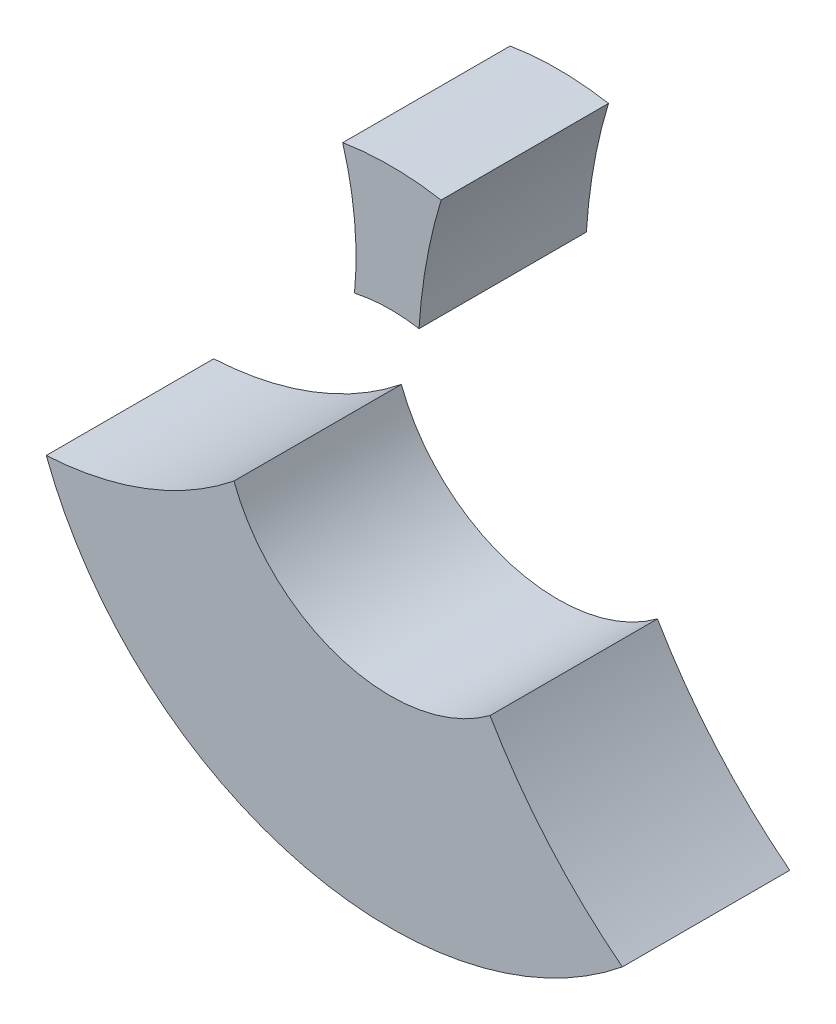
ISO-10303-21;
HEADER;
FILE_DESCRIPTION(('STEP AP214'),'2;1');
FILE_NAME('part.step','',(''),(''),'','','');
FILE_SCHEMA(('AUTOMOTIVE_DESIGN { 1 0 10303 214 1 1 1 1 }'));
ENDSEC;
DATA;
#1=APPLICATION_CONTEXT('core data for automotive mechanical design processes');
#2=APPLICATION_PROTOCOL_DEFINITION('international standard','automotive_design',2000,#1);
#3=PRODUCT_CONTEXT('',#1,'mechanical');
#4=PRODUCT('Part','Part','',(#3));
#5=PRODUCT_RELATED_PRODUCT_CATEGORY('part','',(#4));
#6=PRODUCT_DEFINITION_FORMATION('','',#4);
#7=PRODUCT_DEFINITION_CONTEXT('part definition',#1,'design');
#8=PRODUCT_DEFINITION('design','',#6,#7);
#9=PRODUCT_DEFINITION_SHAPE('','',#8);
#10=(LENGTH_UNIT() NAMED_UNIT(*) SI_UNIT(.MILLI.,.METRE.));
#11=(NAMED_UNIT(*) PLANE_ANGLE_UNIT() SI_UNIT($,.RADIAN.));
#12=(NAMED_UNIT(*) SI_UNIT($,.STERADIAN.) SOLID_ANGLE_UNIT());
#13=UNCERTAINTY_MEASURE_WITH_UNIT(LENGTH_MEASURE(1.E-05),#10,'distance_accuracy_value','');
#14=(GEOMETRIC_REPRESENTATION_CONTEXT(3) GLOBAL_UNCERTAINTY_ASSIGNED_CONTEXT((#13)) GLOBAL_UNIT_ASSIGNED_CONTEXT((#10,
#11,#12)) REPRESENTATION_CONTEXT('',''));
#15=CARTESIAN_POINT('',(0.,0.,0.));
#16=DIRECTION('',(0.,0.,1.));
#17=DIRECTION('',(1.,0.,0.));
#18=AXIS2_PLACEMENT_3D('',#15,#16,#17);
#19=CARTESIAN_POINT('',(0.,0.,6.));
#20=DIRECTION('',(0.,0.,1.));
#21=DIRECTION('',(1.,0.,0.));
#22=AXIS2_PLACEMENT_3D('',#19,#20,#21);
#23=PLANE('',#22);
#24=CARTESIAN_POINT('',(-12.9505437114287,7.00298746775054,6.));
#25=DIRECTION('',(0.,0.,1.));
#26=DIRECTION('',(1.,0.,0.));
#27=AXIS2_PLACEMENT_3D('',#24,#25,#26);
#28=CIRCLE('',#27,11.7196472156143);
#29=CARTESIAN_POINT('',(-12.3347308970566,-4.70046951880307,6.));
#30=VERTEX_POINT('',#29);
#31=CARTESIAN_POINT('',(-5.608507772692,-2.13181625935573,6.));
#32=VERTEX_POINT('',#31);
#33=EDGE_CURVE('E51',#30,#32,#28,.T.);
#34=ORIENTED_EDGE('',*,*,#33,.F.);
#35=CARTESIAN_POINT('',(0.,0.,6.));
#36=DIRECTION('',(0.,0.,1.));
#37=DIRECTION('',(1.,0.,0.));
#38=AXIS2_PLACEMENT_3D('',#35,#36,#37);
#39=CIRCLE('',#38,13.2);
#40=CARTESIAN_POINT('',(8.31171531668762,-10.2545301449818,6.));
#41=VERTEX_POINT('',#40);
#42=EDGE_CURVE('E114',#30,#41,#39,.T.);
#43=ORIENTED_EDGE('',*,*,#42,.T.);
#44=CARTESIAN_POINT('',(20.0229159561683,4.75006481577668,6.));
#45=DIRECTION('',(0.,0.,-1.));
#46=DIRECTION('',(-1.,0.,0.));
#47=AXIS2_PLACEMENT_3D('',#44,#45,#46);
#48=CIRCLE('',#47,19.0339194690582);
#49=CARTESIAN_POINT('',(3.57084024620545,-4.8217320473124,6.));
#50=VERTEX_POINT('',#49);
#51=EDGE_CURVE('E81',#41,#50,#48,.T.);
#52=ORIENTED_EDGE('',*,*,#51,.T.);
#53=CARTESIAN_POINT('',(0.,0.,6.));
#54=DIRECTION('',(0.,0.,1.));
#55=DIRECTION('',(1.,0.,0.));
#56=AXIS2_PLACEMENT_3D('',#53,#54,#55);
#57=CIRCLE('',#56,6.);
#58=EDGE_CURVE('E105',#32,#50,#57,.T.);
#59=ORIENTED_EDGE('',*,*,#58,.F.);
#60=EDGE_LOOP('',(#34,#43,#52,#59));
#61=FACE_BOUND('',#60,.T.);
#62=ADVANCED_FACE('F47',(#61),#23,.T.);
#63=CARTESIAN_POINT('',(0.,0.,0.));
#64=DIRECTION('',(0.,0.,1.));
#65=DIRECTION('',(1.,0.,0.));
#66=AXIS2_PLACEMENT_3D('',#63,#64,#65);
#67=PLANE('',#66);
#68=CARTESIAN_POINT('',(0.,0.,0.));
#69=DIRECTION('',(0.,0.,1.));
#70=DIRECTION('',(1.,0.,0.));
#71=AXIS2_PLACEMENT_3D('',#68,#69,#70);
#72=CIRCLE('',#71,13.2);
#73=CARTESIAN_POINT('',(-12.3347308970566,-4.70046951880307,0.));
#74=VERTEX_POINT('',#73);
#75=CARTESIAN_POINT('',(8.31171531668762,-10.2545301449818,0.));
#76=VERTEX_POINT('',#75);
#77=EDGE_CURVE('E109',#74,#76,#72,.T.);
#78=ORIENTED_EDGE('',*,*,#77,.F.);
#79=CARTESIAN_POINT('',(-12.9505437114287,7.00298746775054,0.));
#80=DIRECTION('',(0.,0.,1.));
#81=DIRECTION('',(1.,0.,0.));
#82=AXIS2_PLACEMENT_3D('',#79,#80,#81);
#83=CIRCLE('',#82,11.7196472156143);
#84=CARTESIAN_POINT('',(-5.608507772692,-2.13181625935573,0.));
#85=VERTEX_POINT('',#84);
#86=EDGE_CURVE('E68',#74,#85,#83,.T.);
#87=ORIENTED_EDGE('',*,*,#86,.T.);
#88=CARTESIAN_POINT('',(0.,0.,0.));
#89=DIRECTION('',(0.,0.,1.));
#90=DIRECTION('',(1.,0.,0.));
#91=AXIS2_PLACEMENT_3D('',#88,#89,#90);
#92=CIRCLE('',#91,6.);
#93=CARTESIAN_POINT('',(3.57084024620545,-4.8217320473124,0.));
#94=VERTEX_POINT('',#93);
#95=EDGE_CURVE('E103',#85,#94,#92,.T.);
#96=ORIENTED_EDGE('',*,*,#95,.T.);
#97=CARTESIAN_POINT('',(20.0229159561683,4.75006481577668,0.));
#98=DIRECTION('',(0.,0.,-1.));
#99=DIRECTION('',(-1.,0.,0.));
#100=AXIS2_PLACEMENT_3D('',#97,#98,#99);
#101=CIRCLE('',#100,19.0339194690582);
#102=EDGE_CURVE('E90',#76,#94,#101,.T.);
#103=ORIENTED_EDGE('',*,*,#102,.F.);
#104=EDGE_LOOP('',(#78,#87,#96,#103));
#105=FACE_BOUND('',#104,.T.);
#106=ADVANCED_FACE('F107',(#105),#67,.F.);
#107=CARTESIAN_POINT('',(0.,0.,6.));
#108=DIRECTION('',(0.,0.,-1.));
#109=DIRECTION('',(-1.,0.,0.));
#110=AXIS2_PLACEMENT_3D('',#107,#108,#109);
#111=CYLINDRICAL_SURFACE('',#110,13.2);
#112=ORIENTED_EDGE('',*,*,#42,.F.);
#113=DIRECTION('',(0.,0.,1.));
#114=VECTOR('',#113,1.);
#115=CARTESIAN_POINT('',(-12.3347308970566,-4.70046951880307,3.));
#116=LINE('',#115,#114);
#117=EDGE_CURVE('E63',#30,#74,#116,.F.);
#118=ORIENTED_EDGE('',*,*,#117,.T.);
#119=ORIENTED_EDGE('',*,*,#77,.T.);
#120=DIRECTION('',(0.,0.,1.));
#121=VECTOR('',#120,1.);
#122=CARTESIAN_POINT('',(8.31171531668763,-10.2545301449818,3.));
#123=LINE('',#122,#121);
#124=EDGE_CURVE('E88',#41,#76,#123,.F.);
#125=ORIENTED_EDGE('',*,*,#124,.F.);
#126=EDGE_LOOP('',(#112,#118,#119,#125));
#127=FACE_BOUND('',#126,.T.);
#128=ADVANCED_FACE('F121',(#127),#111,.T.);
#129=CARTESIAN_POINT('',(0.,0.,6.));
#130=DIRECTION('',(0.,0.,-1.));
#131=DIRECTION('',(-1.,0.,0.));
#132=AXIS2_PLACEMENT_3D('',#129,#130,#131);
#133=CYLINDRICAL_SURFACE('',#132,6.);
#134=DIRECTION('',(0.,0.,1.));
#135=VECTOR('',#134,1.);
#136=CARTESIAN_POINT('',(-5.608507772692,-2.13181625935573,3.));
#137=LINE('',#136,#135);
#138=EDGE_CURVE('E12',#32,#85,#137,.F.);
#139=ORIENTED_EDGE('',*,*,#138,.F.);
#140=ORIENTED_EDGE('',*,*,#58,.T.);
#141=DIRECTION('',(0.,0.,1.));
#142=VECTOR('',#141,1.);
#143=CARTESIAN_POINT('',(3.57084024620545,-4.82173204731239,3.));
#144=LINE('',#143,#142);
#145=EDGE_CURVE('E93',#50,#94,#144,.F.);
#146=ORIENTED_EDGE('',*,*,#145,.T.);
#147=ORIENTED_EDGE('',*,*,#95,.F.);
#148=EDGE_LOOP('',(#139,#140,#146,#147));
#149=FACE_BOUND('',#148,.T.);
#150=ADVANCED_FACE('F102',(#149),#133,.F.);
#151=CARTESIAN_POINT('',(20.0229159561683,4.75006481577668,0.));
#152=DIRECTION('',(0.,0.,1.));
#153=DIRECTION('',(1.,0.,0.));
#154=AXIS2_PLACEMENT_3D('',#151,#152,#153);
#155=CYLINDRICAL_SURFACE('',#154,19.0339194690582);
#156=ORIENTED_EDGE('',*,*,#124,.T.);
#157=ORIENTED_EDGE('',*,*,#102,.T.);
#158=ORIENTED_EDGE('',*,*,#145,.F.);
#159=ORIENTED_EDGE('',*,*,#51,.F.);
#160=EDGE_LOOP('',(#156,#157,#158,#159));
#161=FACE_BOUND('',#160,.T.);
#162=ADVANCED_FACE('F92',(#161),#155,.F.);
#163=CARTESIAN_POINT('',(-12.9505437114287,7.00298746775054,0.));
#164=DIRECTION('',(0.,0.,1.));
#165=DIRECTION('',(1.,0.,0.));
#166=AXIS2_PLACEMENT_3D('',#163,#164,#165);
#167=CYLINDRICAL_SURFACE('',#166,11.7196472156143);
#168=ORIENTED_EDGE('',*,*,#33,.T.);
#169=ORIENTED_EDGE('',*,*,#138,.T.);
#170=ORIENTED_EDGE('',*,*,#86,.F.);
#171=ORIENTED_EDGE('',*,*,#117,.F.);
#172=EDGE_LOOP('',(#168,#169,#170,#171));
#173=FACE_BOUND('',#172,.T.);
#174=ADVANCED_FACE('F49',(#173),#167,.F.);
#175=CLOSED_SHELL('',(#62,#106,#128,#150,#162,#174));
#176=MANIFOLD_SOLID_BREP('B2',#175);
#177=CARTESIAN_POINT('',(0.,0.,6.));
#178=DIRECTION('',(0.,0.,-1.));
#179=DIRECTION('',(-1.,0.,0.));
#180=AXIS2_PLACEMENT_3D('',#177,#178,#179);
#181=CYLINDRICAL_SURFACE('',#180,6.);
#182=DIRECTION('',(0.,0.,1.));
#183=VECTOR('',#182,1.);
#184=CARTESIAN_POINT('',(-1.28672641628347,5.86040400737341,3.));
#185=LINE('',#184,#183);
#186=CARTESIAN_POINT('',(-1.28672641628347,5.86040400737341,0.));
#187=VERTEX_POINT('',#186);
#188=CARTESIAN_POINT('',(-1.28672641628347,5.86040400737341,6.));
#189=VERTEX_POINT('',#188);
#190=EDGE_CURVE('E45',#187,#189,#185,.T.);
#191=ORIENTED_EDGE('',*,*,#190,.F.);
#192=CARTESIAN_POINT('',(0.,0.,0.));
#193=DIRECTION('',(0.,0.,1.));
#194=DIRECTION('',(1.,0.,0.));
#195=AXIS2_PLACEMENT_3D('',#192,#193,#194);
#196=CIRCLE('',#195,6.);
#197=CARTESIAN_POINT('',(1.02448822055343,5.91188835195213,0.));
#198=VERTEX_POINT('',#197);
#199=EDGE_CURVE('E241',#198,#187,#196,.T.);
#200=ORIENTED_EDGE('',*,*,#199,.F.);
#201=DIRECTION('',(0.,0.,1.));
#202=VECTOR('',#201,1.);
#203=CARTESIAN_POINT('',(1.02448822055343,5.91188835195213,3.));
#204=LINE('',#203,#202);
#205=CARTESIAN_POINT('',(1.02448822055343,5.91188835195213,6.));
#206=VERTEX_POINT('',#205);
#207=EDGE_CURVE('E191',#198,#206,#204,.T.);
#208=ORIENTED_EDGE('',*,*,#207,.T.);
#209=CARTESIAN_POINT('',(0.,0.,6.));
#210=DIRECTION('',(0.,0.,1.));
#211=DIRECTION('',(1.,0.,0.));
#212=AXIS2_PLACEMENT_3D('',#209,#210,#211);
#213=CIRCLE('',#212,6.);
#214=EDGE_CURVE('E250',#206,#189,#213,.T.);
#215=ORIENTED_EDGE('',*,*,#214,.T.);
#216=EDGE_LOOP('',(#191,#200,#208,#215));
#217=FACE_BOUND('',#216,.T.);
#218=ADVANCED_FACE('F183',(#217),#181,.F.);
#219=CARTESIAN_POINT('',(0.,0.,0.));
#220=DIRECTION('',(0.,0.,1.));
#221=DIRECTION('',(1.,0.,0.));
#222=AXIS2_PLACEMENT_3D('',#219,#220,#221);
#223=PLANE('',#222);
#224=ORIENTED_EDGE('',*,*,#199,.T.);
#225=CARTESIAN_POINT('',(-12.9505437114287,7.00298746775054,0.));
#226=DIRECTION('',(0.,0.,1.));
#227=DIRECTION('',(1.,0.,0.));
#228=AXIS2_PLACEMENT_3D('',#225,#226,#227);
#229=CIRCLE('',#228,11.7196472156143);
#230=CARTESIAN_POINT('',(-1.71010071662834,10.32,0.));
#231=VERTEX_POINT('',#230);
#232=EDGE_CURVE('E223',#187,#231,#229,.T.);
#233=ORIENTED_EDGE('',*,*,#232,.T.);
#234=CARTESIAN_POINT('',(0.,0.,0.));
#235=DIRECTION('',(0.,0.,-1.));
#236=DIRECTION('',(-1.,0.,0.));
#237=AXIS2_PLACEMENT_3D('',#234,#235,#236);
#238=CIRCLE('',#237,10.4607286773443);
#239=CARTESIAN_POINT('',(1.81663820774605,10.301779947328,0.));
#240=VERTEX_POINT('',#239);
#241=EDGE_CURVE('E235',#231,#240,#238,.T.);
#242=ORIENTED_EDGE('',*,*,#241,.T.);
#243=CARTESIAN_POINT('',(20.0229159561683,4.75006481577668,0.));
#244=DIRECTION('',(0.,0.,-1.));
#245=DIRECTION('',(-1.,0.,0.));
#246=AXIS2_PLACEMENT_3D('',#243,#244,#245);
#247=CIRCLE('',#246,19.0339194690582);
#248=EDGE_CURVE('E231',#198,#240,#247,.T.);
#249=ORIENTED_EDGE('',*,*,#248,.F.);
#250=EDGE_LOOP('',(#224,#233,#242,#249));
#251=FACE_BOUND('',#250,.T.);
#252=ADVANCED_FACE('F185',(#251),#223,.F.);
#253=CARTESIAN_POINT('',(0.,0.,6.));
#254=DIRECTION('',(0.,0.,1.));
#255=DIRECTION('',(1.,0.,0.));
#256=AXIS2_PLACEMENT_3D('',#253,#254,#255);
#257=PLANE('',#256);
#258=CARTESIAN_POINT('',(-12.9505437114287,7.00298746775054,6.));
#259=DIRECTION('',(0.,0.,1.));
#260=DIRECTION('',(1.,0.,0.));
#261=AXIS2_PLACEMENT_3D('',#258,#259,#260);
#262=CIRCLE('',#261,11.7196472156143);
#263=CARTESIAN_POINT('',(-1.71010071662834,10.32,6.));
#264=VERTEX_POINT('',#263);
#265=EDGE_CURVE('E226',#189,#264,#262,.T.);
#266=ORIENTED_EDGE('',*,*,#265,.F.);
#267=ORIENTED_EDGE('',*,*,#214,.F.);
#268=CARTESIAN_POINT('',(20.0229159561683,4.75006481577668,6.));
#269=DIRECTION('',(0.,0.,-1.));
#270=DIRECTION('',(-1.,0.,0.));
#271=AXIS2_PLACEMENT_3D('',#268,#269,#270);
#272=CIRCLE('',#271,19.0339194690582);
#273=CARTESIAN_POINT('',(1.81663820774605,10.301779947328,6.));
#274=VERTEX_POINT('',#273);
#275=EDGE_CURVE('E198',#206,#274,#272,.T.);
#276=ORIENTED_EDGE('',*,*,#275,.T.);
#277=CARTESIAN_POINT('',(0.,0.,6.));
#278=DIRECTION('',(0.,0.,-1.));
#279=DIRECTION('',(-1.,0.,0.));
#280=AXIS2_PLACEMENT_3D('',#277,#278,#279);
#281=CIRCLE('',#280,10.4607286773443);
#282=EDGE_CURVE('E243',#264,#274,#281,.T.);
#283=ORIENTED_EDGE('',*,*,#282,.F.);
#284=EDGE_LOOP('',(#266,#267,#276,#283));
#285=FACE_BOUND('',#284,.T.);
#286=ADVANCED_FACE('F256',(#285),#257,.T.);
#287=CARTESIAN_POINT('',(20.0229159561683,4.75006481577668,0.));
#288=DIRECTION('',(0.,0.,1.));
#289=DIRECTION('',(1.,0.,0.));
#290=AXIS2_PLACEMENT_3D('',#287,#288,#289);
#291=CYLINDRICAL_SURFACE('',#290,19.0339194690582);
#292=ORIENTED_EDGE('',*,*,#248,.T.);
#293=DIRECTION('',(0.,0.,1.));
#294=VECTOR('',#293,1.);
#295=CARTESIAN_POINT('',(1.81663820774605,10.301779947328,0.));
#296=LINE('',#295,#294);
#297=EDGE_CURVE('E230',#240,#274,#296,.T.);
#298=ORIENTED_EDGE('',*,*,#297,.T.);
#299=ORIENTED_EDGE('',*,*,#275,.F.);
#300=ORIENTED_EDGE('',*,*,#207,.F.);
#301=EDGE_LOOP('',(#292,#298,#299,#300));
#302=FACE_BOUND('',#301,.T.);
#303=ADVANCED_FACE('F258',(#302),#291,.F.);
#304=CARTESIAN_POINT('',(-12.9505437114287,7.00298746775054,0.));
#305=DIRECTION('',(0.,0.,1.));
#306=DIRECTION('',(1.,0.,0.));
#307=AXIS2_PLACEMENT_3D('',#304,#305,#306);
#308=CYLINDRICAL_SURFACE('',#307,11.7196472156143);
#309=ORIENTED_EDGE('',*,*,#190,.T.);
#310=ORIENTED_EDGE('',*,*,#265,.T.);
#311=DIRECTION('',(0.,0.,1.));
#312=VECTOR('',#311,1.);
#313=CARTESIAN_POINT('',(-1.71010071662834,10.32,0.));
#314=LINE('',#313,#312);
#315=EDGE_CURVE('E219',#231,#264,#314,.T.);
#316=ORIENTED_EDGE('',*,*,#315,.F.);
#317=ORIENTED_EDGE('',*,*,#232,.F.);
#318=EDGE_LOOP('',(#309,#310,#316,#317));
#319=FACE_BOUND('',#318,.T.);
#320=ADVANCED_FACE('F221',(#319),#308,.F.);
#321=CARTESIAN_POINT('',(0.,0.,0.));
#322=DIRECTION('',(0.,0.,1.));
#323=DIRECTION('',(1.,0.,0.));
#324=AXIS2_PLACEMENT_3D('',#321,#322,#323);
#325=CYLINDRICAL_SURFACE('',#324,10.4607286773443);
#326=ORIENTED_EDGE('',*,*,#282,.T.);
#327=ORIENTED_EDGE('',*,*,#297,.F.);
#328=ORIENTED_EDGE('',*,*,#241,.F.);
#329=ORIENTED_EDGE('',*,*,#315,.T.);
#330=EDGE_LOOP('',(#326,#327,#328,#329));
#331=FACE_BOUND('',#330,.T.);
#332=ADVANCED_FACE('F236',(#331),#325,.T.);
#333=CLOSED_SHELL('',(#218,#252,#286,#303,#320,#332));
#334=MANIFOLD_SOLID_BREP('B6',#333);
#335=ADVANCED_BREP_SHAPE_REPRESENTATION('',(#18,#176,#334),#14);
#336=SHAPE_DEFINITION_REPRESENTATION(#9,#335);
ENDSEC;
END-ISO-10303-21;
